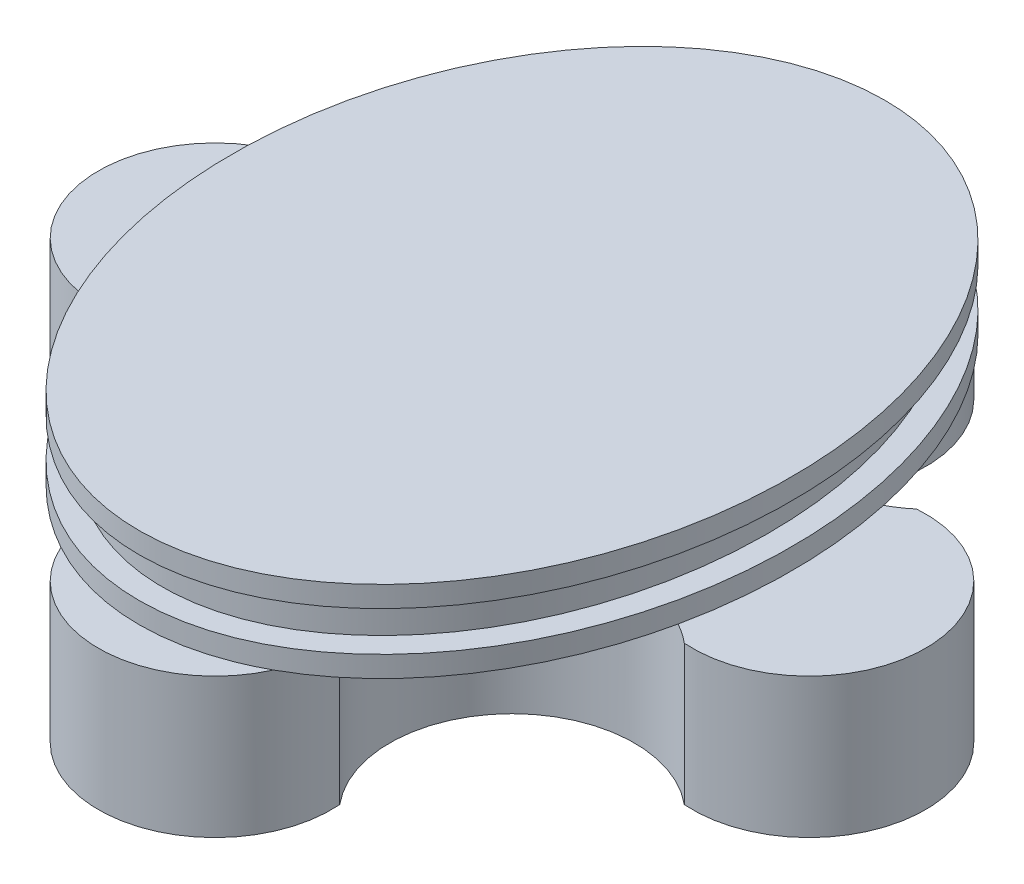
ISO-10303-21;
HEADER;
FILE_DESCRIPTION(('STEP AP214'),'2;1');
FILE_NAME('part.step','',(''),(''),'','','');
FILE_SCHEMA(('AUTOMOTIVE_DESIGN { 1 0 10303 214 1 1 1 1 }'));
ENDSEC;
DATA;
#1=APPLICATION_CONTEXT('core data for automotive mechanical design processes');
#2=APPLICATION_PROTOCOL_DEFINITION('international standard','automotive_design',2000,#1);
#3=PRODUCT_CONTEXT('',#1,'mechanical');
#4=PRODUCT('Part','Part','',(#3));
#5=PRODUCT_RELATED_PRODUCT_CATEGORY('part','',(#4));
#6=PRODUCT_DEFINITION_FORMATION('','',#4);
#7=PRODUCT_DEFINITION_CONTEXT('part definition',#1,'design');
#8=PRODUCT_DEFINITION('design','',#6,#7);
#9=PRODUCT_DEFINITION_SHAPE('','',#8);
#10=(LENGTH_UNIT() NAMED_UNIT(*) SI_UNIT(.MILLI.,.METRE.));
#11=(NAMED_UNIT(*) PLANE_ANGLE_UNIT() SI_UNIT($,.RADIAN.));
#12=(NAMED_UNIT(*) SI_UNIT($,.STERADIAN.) SOLID_ANGLE_UNIT());
#13=UNCERTAINTY_MEASURE_WITH_UNIT(LENGTH_MEASURE(1.E-05),#10,'distance_accuracy_value','');
#14=(GEOMETRIC_REPRESENTATION_CONTEXT(3) GLOBAL_UNCERTAINTY_ASSIGNED_CONTEXT((#13)) GLOBAL_UNIT_ASSIGNED_CONTEXT((#10,
#11,#12)) REPRESENTATION_CONTEXT('',''));
#15=CARTESIAN_POINT('',(0.,0.,0.));
#16=DIRECTION('',(0.,0.,1.));
#17=DIRECTION('',(1.,0.,0.));
#18=AXIS2_PLACEMENT_3D('',#15,#16,#17);
#19=CARTESIAN_POINT('',(0.,0.,0.));
#20=DIRECTION('',(0.,1.,0.));
#21=DIRECTION('',(0.,0.,1.));
#22=AXIS2_PLACEMENT_3D('',#19,#20,#21);
#23=PLANE('',#22);
#24=CARTESIAN_POINT('',(0.,0.,0.));
#25=DIRECTION('',(0.,1.,0.));
#26=DIRECTION('',(0.,0.,-1.));
#27=AXIS2_PLACEMENT_3D('',#24,#25,#26);
#28=ELLIPSE('',#27,16.,12.);
#29=CARTESIAN_POINT('',(-11.5350552187258,0.,4.41059353041869));
#30=VERTEX_POINT('',#29);
#31=CARTESIAN_POINT('',(-4.56069619587107,0.,14.799402402888));
#32=VERTEX_POINT('',#31);
#33=EDGE_CURVE('E224',#30,#32,#28,.T.);
#34=ORIENTED_EDGE('',*,*,#33,.F.);
#35=CARTESIAN_POINT('',(-9.01499999999982,0.,9.01622287878911));
#36=DIRECTION('',(0.,-1.,0.));
#37=DIRECTION('',(0.,0.,-1.));
#38=AXIS2_PLACEMENT_3D('',#35,#36,#37);
#39=CIRCLE('',#38,5.2499999999999);
#40=CARTESIAN_POINT('',(-4.9864961665555,0.,12.3827725760197));
#41=VERTEX_POINT('',#40);
#42=EDGE_CURVE('E55',#30,#41,#39,.T.);
#43=ORIENTED_EDGE('',*,*,#42,.T.);
#44=CARTESIAN_POINT('',(2.5381832073261E-13,0.,12.75));
#45=DIRECTION('',(0.,-1.,0.));
#46=DIRECTION('',(0.,0.,-1.));
#47=AXIS2_PLACEMENT_3D('',#44,#45,#46);
#48=CIRCLE('',#47,4.99999999999984);
#49=EDGE_CURVE('E191',#32,#41,#48,.T.);
#50=ORIENTED_EDGE('',*,*,#49,.F.);
#51=EDGE_LOOP('',(#34,#43,#50));
#52=FACE_BOUND('',#51,.T.);
#53=ADVANCED_FACE('F45',(#52),#23,.F.);
#54=CARTESIAN_POINT('',(0.,0.,-12.75));
#55=DIRECTION('',(0.,-1.,0.));
#56=DIRECTION('',(0.,0.,-1.));
#57=AXIS2_PLACEMENT_3D('',#54,#55,#56);
#58=CIRCLE('',#57,5.);
#59=CARTESIAN_POINT('',(-4.98627820309729,0.,-12.3798247964586));
#60=VERTEX_POINT('',#59);
#61=CARTESIAN_POINT('',(-4.56069619587164,0.,-14.7994024028877));
#62=VERTEX_POINT('',#61);
#63=EDGE_CURVE('E174',#60,#62,#58,.T.);
#64=ORIENTED_EDGE('',*,*,#63,.F.);
#65=CARTESIAN_POINT('',(-9.01622287878913,0.,-9.01499999999997));
#66=DIRECTION('',(0.,-1.,0.));
#67=DIRECTION('',(0.,0.,-1.));
#68=AXIS2_PLACEMENT_3D('',#65,#66,#67);
#69=CIRCLE('',#68,5.25);
#70=CARTESIAN_POINT('',(-11.5354192149795,0.,-4.40890080222699));
#71=VERTEX_POINT('',#70);
#72=EDGE_CURVE('E145',#60,#71,#69,.T.);
#73=ORIENTED_EDGE('',*,*,#72,.T.);
#74=EDGE_CURVE('E217',#62,#71,#28,.T.);
#75=ORIENTED_EDGE('',*,*,#74,.F.);
#76=EDGE_LOOP('',(#64,#73,#75));
#77=FACE_BOUND('',#76,.T.);
#78=ADVANCED_FACE('F262',(#77),#23,.F.);
#79=CARTESIAN_POINT('',(4.98627820309738,0.,12.3798247964586));
#80=VERTEX_POINT('',#79);
#81=CARTESIAN_POINT('',(4.56069619587174,0.,14.7994024028877));
#82=VERTEX_POINT('',#81);
#83=EDGE_CURVE('E187',#80,#82,#48,.T.);
#84=ORIENTED_EDGE('',*,*,#83,.F.);
#85=CARTESIAN_POINT('',(9.01622287878919,0.,9.01499999999991));
#86=DIRECTION('',(0.,-1.,0.));
#87=DIRECTION('',(0.,0.,-1.));
#88=AXIS2_PLACEMENT_3D('',#85,#86,#87);
#89=CIRCLE('',#88,5.25);
#90=CARTESIAN_POINT('',(11.5354192149795,0.,4.4089008022269));
#91=VERTEX_POINT('',#90);
#92=EDGE_CURVE('E183',#80,#91,#89,.T.);
#93=ORIENTED_EDGE('',*,*,#92,.T.);
#94=EDGE_CURVE('E230',#82,#91,#28,.T.);
#95=ORIENTED_EDGE('',*,*,#94,.F.);
#96=EDGE_LOOP('',(#84,#93,#95));
#97=FACE_BOUND('',#96,.T.);
#98=ADVANCED_FACE('F266',(#97),#23,.F.);
#99=CARTESIAN_POINT('',(0.,0.9,0.));
#100=DIRECTION('',(0.,1.,0.));
#101=DIRECTION('',(0.,0.,-1.));
#102=AXIS2_PLACEMENT_3D('',#99,#100,#101);
#103=ELLIPSE('',#102,16.,12.);
#104=DIRECTION('',(0.,-1.,0.));
#105=VECTOR('',#104,1.);
#106=SURFACE_OF_LINEAR_EXTRUSION('',#103,#105);
#107=CARTESIAN_POINT('',(0.,0.9,-16.));
#108=VERTEX_POINT('',#107);
#109=EDGE_CURVE('E214',#108,#108,#103,.T.);
#110=ORIENTED_EDGE('',*,*,#109,.F.);
#111=EDGE_LOOP('',(#110));
#112=FACE_BOUND('',#111,.T.);
#113=ORIENTED_EDGE('',*,*,#74,.T.);
#114=EDGE_CURVE('E219',#71,#30,#28,.T.);
#115=ORIENTED_EDGE('',*,*,#114,.T.);
#116=ORIENTED_EDGE('',*,*,#33,.T.);
#117=EDGE_CURVE('E232',#32,#82,#28,.T.);
#118=ORIENTED_EDGE('',*,*,#117,.T.);
#119=ORIENTED_EDGE('',*,*,#94,.T.);
#120=CARTESIAN_POINT('',(11.5350552187259,0.,-4.41059353041851));
#121=VERTEX_POINT('',#120);
#122=EDGE_CURVE('E227',#91,#121,#28,.T.);
#123=ORIENTED_EDGE('',*,*,#122,.T.);
#124=CARTESIAN_POINT('',(4.56069619587164,0.,-14.7994024028877));
#125=VERTEX_POINT('',#124);
#126=EDGE_CURVE('E225',#121,#125,#28,.T.);
#127=ORIENTED_EDGE('',*,*,#126,.T.);
#128=EDGE_CURVE('E152',#125,#62,#28,.T.);
#129=ORIENTED_EDGE('',*,*,#128,.T.);
#130=EDGE_LOOP('',(#113,#115,#116,#118,#119,#123,#127,#129));
#131=FACE_BOUND('',#130,.T.);
#132=ADVANCED_FACE('F47',(#112,#131),#106,.F.);
#133=CARTESIAN_POINT('',(0.,0.9,0.));
#134=DIRECTION('',(0.,1.,0.));
#135=DIRECTION('',(0.,0.,1.));
#136=AXIS2_PLACEMENT_3D('',#133,#134,#135);
#137=PLANE('',#136);
#138=CARTESIAN_POINT('',(0.,0.9,0.));
#139=DIRECTION('',(0.,1.,0.));
#140=DIRECTION('',(0.,0.,-1.));
#141=AXIS2_PLACEMENT_3D('',#138,#139,#140);
#142=ELLIPSE('',#141,15.,11.);
#143=CARTESIAN_POINT('',(0.,0.9,-15.));
#144=VERTEX_POINT('',#143);
#145=EDGE_CURVE('E11',#144,#144,#142,.T.);
#146=ORIENTED_EDGE('',*,*,#145,.F.);
#147=EDGE_LOOP('',(#146));
#148=FACE_BOUND('',#147,.T.);
#149=ORIENTED_EDGE('',*,*,#109,.T.);
#150=EDGE_LOOP('',(#149));
#151=FACE_BOUND('',#150,.T.);
#152=ADVANCED_FACE('F270',(#148,#151),#137,.T.);
#153=CARTESIAN_POINT('',(4.98649616655595,0.,-12.3827725760202));
#154=VERTEX_POINT('',#153);
#155=EDGE_CURVE('E151',#125,#154,#58,.T.);
#156=ORIENTED_EDGE('',*,*,#155,.F.);
#157=ORIENTED_EDGE('',*,*,#126,.F.);
#158=CARTESIAN_POINT('',(9.015,0.,-9.0162228787891));
#159=DIRECTION('',(0.,-1.,0.));
#160=DIRECTION('',(0.,0.,-1.));
#161=AXIS2_PLACEMENT_3D('',#158,#159,#160);
#162=CIRCLE('',#161,5.25);
#163=EDGE_CURVE('E68',#121,#154,#162,.T.);
#164=ORIENTED_EDGE('',*,*,#163,.T.);
#165=EDGE_LOOP('',(#156,#157,#164));
#166=FACE_BOUND('',#165,.T.);
#167=ADVANCED_FACE('F257',(#166),#23,.F.);
#168=CARTESIAN_POINT('',(0.,0.,0.));
#169=DIRECTION('',(0.,-1.,0.));
#170=DIRECTION('',(0.,0.,-1.));
#171=AXIS2_PLACEMENT_3D('',#168,#169,#170);
#172=PLANE('',#171);
#173=ORIENTED_EDGE('',*,*,#114,.F.);
#174=CARTESIAN_POINT('',(-12.3827725760202,0.,-4.9864961665559));
#175=VERTEX_POINT('',#174);
#176=EDGE_CURVE('E197',#71,#175,#69,.T.);
#177=ORIENTED_EDGE('',*,*,#176,.T.);
#178=CARTESIAN_POINT('',(-12.75,0.,0.));
#179=DIRECTION('',(0.,-1.,0.));
#180=DIRECTION('',(0.,0.,-1.));
#181=AXIS2_PLACEMENT_3D('',#178,#179,#180);
#182=CIRCLE('',#181,5.);
#183=CARTESIAN_POINT('',(-12.3798247964584,0.,4.98627820309731));
#184=VERTEX_POINT('',#183);
#185=EDGE_CURVE('E194',#184,#175,#182,.T.);
#186=ORIENTED_EDGE('',*,*,#185,.F.);
#187=EDGE_CURVE('E190',#184,#30,#39,.T.);
#188=ORIENTED_EDGE('',*,*,#187,.T.);
#189=EDGE_LOOP('',(#173,#177,#186,#188));
#190=FACE_BOUND('',#189,.T.);
#191=ADVANCED_FACE('F249',(#190),#172,.F.);
#192=ORIENTED_EDGE('',*,*,#117,.F.);
#193=EDGE_CURVE('E186',#82,#32,#48,.T.);
#194=ORIENTED_EDGE('',*,*,#193,.F.);
#195=EDGE_LOOP('',(#192,#194));
#196=FACE_BOUND('',#195,.T.);
#197=ADVANCED_FACE('F246',(#196),#172,.F.);
#198=ORIENTED_EDGE('',*,*,#122,.F.);
#199=CARTESIAN_POINT('',(12.3827725760202,0.,4.98649616655582));
#200=VERTEX_POINT('',#199);
#201=EDGE_CURVE('E182',#91,#200,#89,.T.);
#202=ORIENTED_EDGE('',*,*,#201,.T.);
#203=CARTESIAN_POINT('',(12.75,0.,-1.3354916121075E-13));
#204=DIRECTION('',(0.,-1.,0.));
#205=DIRECTION('',(0.,0.,-1.));
#206=AXIS2_PLACEMENT_3D('',#203,#204,#205);
#207=CIRCLE('',#206,5.);
#208=CARTESIAN_POINT('',(12.3798247964589,0.,-4.98627820309744));
#209=VERTEX_POINT('',#208);
#210=EDGE_CURVE('E179',#209,#200,#207,.T.);
#211=ORIENTED_EDGE('',*,*,#210,.F.);
#212=EDGE_CURVE('E176',#209,#121,#162,.T.);
#213=ORIENTED_EDGE('',*,*,#212,.T.);
#214=EDGE_LOOP('',(#198,#202,#211,#213));
#215=FACE_BOUND('',#214,.T.);
#216=ADVANCED_FACE('F248',(#215),#172,.F.);
#217=CARTESIAN_POINT('',(0.,-6.,-12.75));
#218=DIRECTION('',(0.,1.,0.));
#219=DIRECTION('',(0.,0.,1.));
#220=AXIS2_PLACEMENT_3D('',#217,#218,#219);
#221=CYLINDRICAL_SURFACE('',#220,5.);
#222=ORIENTED_EDGE('',*,*,#63,.T.);
#223=EDGE_CURVE('E177',#62,#125,#58,.T.);
#224=ORIENTED_EDGE('',*,*,#223,.T.);
#225=ORIENTED_EDGE('',*,*,#155,.T.);
#226=DIRECTION('',(0.,1.,0.));
#227=VECTOR('',#226,1.);
#228=CARTESIAN_POINT('',(4.98649616655595,-6.,-12.3827725760202));
#229=LINE('',#228,#227);
#230=CARTESIAN_POINT('',(4.98649616655595,-6.,-12.3827725760202));
#231=VERTEX_POINT('',#230);
#232=EDGE_CURVE('E63',#231,#154,#229,.T.);
#233=ORIENTED_EDGE('',*,*,#232,.F.);
#234=CARTESIAN_POINT('',(0.,-6.,-12.75));
#235=DIRECTION('',(0.,-1.,0.));
#236=DIRECTION('',(0.,0.,-1.));
#237=AXIS2_PLACEMENT_3D('',#234,#235,#236);
#238=CIRCLE('',#237,5.);
#239=CARTESIAN_POINT('',(-4.98627820309729,-6.,-12.3798247964586));
#240=VERTEX_POINT('',#239);
#241=EDGE_CURVE('E139',#240,#231,#238,.T.);
#242=ORIENTED_EDGE('',*,*,#241,.F.);
#243=DIRECTION('',(0.,1.,0.));
#244=VECTOR('',#243,1.);
#245=CARTESIAN_POINT('',(-4.98627820309729,-6.,-12.3798247964586));
#246=LINE('',#245,#244);
#247=EDGE_CURVE('E173',#240,#60,#246,.T.);
#248=ORIENTED_EDGE('',*,*,#247,.T.);
#249=EDGE_LOOP('',(#222,#224,#225,#233,#242,#248));
#250=FACE_BOUND('',#249,.T.);
#251=ADVANCED_FACE('F148',(#250),#221,.T.);
#252=CARTESIAN_POINT('',(9.015,-6.,-9.0162228787891));
#253=DIRECTION('',(0.,1.,0.));
#254=DIRECTION('',(0.,0.,1.));
#255=AXIS2_PLACEMENT_3D('',#252,#253,#254);
#256=CYLINDRICAL_SURFACE('',#255,5.25);
#257=ORIENTED_EDGE('',*,*,#212,.F.);
#258=DIRECTION('',(0.,1.,0.));
#259=VECTOR('',#258,1.);
#260=CARTESIAN_POINT('',(12.3798247964589,-6.,-4.98627820309744));
#261=LINE('',#260,#259);
#262=CARTESIAN_POINT('',(12.3798247964589,-6.,-4.98627820309744));
#263=VERTEX_POINT('',#262);
#264=EDGE_CURVE('E153',#263,#209,#261,.T.);
#265=ORIENTED_EDGE('',*,*,#264,.F.);
#266=CARTESIAN_POINT('',(9.015,-6.,-9.0162228787891));
#267=DIRECTION('',(0.,-1.,0.));
#268=DIRECTION('',(0.,0.,-1.));
#269=AXIS2_PLACEMENT_3D('',#266,#267,#268);
#270=CIRCLE('',#269,5.25);
#271=EDGE_CURVE('E141',#263,#231,#270,.T.);
#272=ORIENTED_EDGE('',*,*,#271,.T.);
#273=ORIENTED_EDGE('',*,*,#232,.T.);
#274=ORIENTED_EDGE('',*,*,#163,.F.);
#275=EDGE_LOOP('',(#257,#265,#272,#273,#274));
#276=FACE_BOUND('',#275,.T.);
#277=ADVANCED_FACE('F155',(#276),#256,.F.);
#278=CARTESIAN_POINT('',(12.75,-6.,-1.3354916121075E-13));
#279=DIRECTION('',(0.,1.,0.));
#280=DIRECTION('',(0.,0.,1.));
#281=AXIS2_PLACEMENT_3D('',#278,#279,#280);
#282=CYLINDRICAL_SURFACE('',#281,5.);
#283=ORIENTED_EDGE('',*,*,#210,.T.);
#284=DIRECTION('',(0.,1.,0.));
#285=VECTOR('',#284,1.);
#286=CARTESIAN_POINT('',(12.3827725760202,-6.,4.98649616655582));
#287=LINE('',#286,#285);
#288=CARTESIAN_POINT('',(12.3827725760202,-6.,4.98649616655582));
#289=VERTEX_POINT('',#288);
#290=EDGE_CURVE('E211',#289,#200,#287,.T.);
#291=ORIENTED_EDGE('',*,*,#290,.F.);
#292=CARTESIAN_POINT('',(12.75,-6.,-1.3354916121075E-13));
#293=DIRECTION('',(0.,-1.,0.));
#294=DIRECTION('',(0.,0.,-1.));
#295=AXIS2_PLACEMENT_3D('',#292,#293,#294);
#296=CIRCLE('',#295,5.);
#297=EDGE_CURVE('E157',#263,#289,#296,.T.);
#298=ORIENTED_EDGE('',*,*,#297,.F.);
#299=ORIENTED_EDGE('',*,*,#264,.T.);
#300=EDGE_LOOP('',(#283,#291,#298,#299));
#301=FACE_BOUND('',#300,.T.);
#302=ADVANCED_FACE('F290',(#301),#282,.T.);
#303=CARTESIAN_POINT('',(9.01622287878919,-6.,9.01499999999991));
#304=DIRECTION('',(0.,1.,0.));
#305=DIRECTION('',(0.,0.,1.));
#306=AXIS2_PLACEMENT_3D('',#303,#304,#305);
#307=CYLINDRICAL_SURFACE('',#306,5.25);
#308=ORIENTED_EDGE('',*,*,#92,.F.);
#309=DIRECTION('',(0.,1.,0.));
#310=VECTOR('',#309,1.);
#311=CARTESIAN_POINT('',(4.98627820309738,-6.,12.3798247964586));
#312=LINE('',#311,#310);
#313=CARTESIAN_POINT('',(4.98627820309738,-6.,12.3798247964586));
#314=VERTEX_POINT('',#313);
#315=EDGE_CURVE('E209',#314,#80,#312,.T.);
#316=ORIENTED_EDGE('',*,*,#315,.F.);
#317=CARTESIAN_POINT('',(9.01622287878919,-6.,9.01499999999991));
#318=DIRECTION('',(0.,-1.,0.));
#319=DIRECTION('',(0.,0.,-1.));
#320=AXIS2_PLACEMENT_3D('',#317,#318,#319);
#321=CIRCLE('',#320,5.25);
#322=EDGE_CURVE('E159',#314,#289,#321,.T.);
#323=ORIENTED_EDGE('',*,*,#322,.T.);
#324=ORIENTED_EDGE('',*,*,#290,.T.);
#325=ORIENTED_EDGE('',*,*,#201,.F.);
#326=EDGE_LOOP('',(#308,#316,#323,#324,#325));
#327=FACE_BOUND('',#326,.T.);
#328=ADVANCED_FACE('F285',(#327),#307,.F.);
#329=CARTESIAN_POINT('',(2.5381832073261E-13,-6.,12.75));
#330=DIRECTION('',(0.,1.,0.));
#331=DIRECTION('',(0.,0.,1.));
#332=AXIS2_PLACEMENT_3D('',#329,#330,#331);
#333=CYLINDRICAL_SURFACE('',#332,4.99999999999984);
#334=ORIENTED_EDGE('',*,*,#83,.T.);
#335=ORIENTED_EDGE('',*,*,#193,.T.);
#336=ORIENTED_EDGE('',*,*,#49,.T.);
#337=DIRECTION('',(0.,1.,0.));
#338=VECTOR('',#337,1.);
#339=CARTESIAN_POINT('',(-4.9864961665555,-6.,12.3827725760197));
#340=LINE('',#339,#338);
#341=CARTESIAN_POINT('',(-4.9864961665555,-6.,12.3827725760197));
#342=VERTEX_POINT('',#341);
#343=EDGE_CURVE('E206',#342,#41,#340,.T.);
#344=ORIENTED_EDGE('',*,*,#343,.F.);
#345=CARTESIAN_POINT('',(2.5381832073261E-13,-6.,12.75));
#346=DIRECTION('',(0.,-1.,0.));
#347=DIRECTION('',(0.,0.,-1.));
#348=AXIS2_PLACEMENT_3D('',#345,#346,#347);
#349=CIRCLE('',#348,4.99999999999984);
#350=EDGE_CURVE('E165',#314,#342,#349,.T.);
#351=ORIENTED_EDGE('',*,*,#350,.F.);
#352=ORIENTED_EDGE('',*,*,#315,.T.);
#353=EDGE_LOOP('',(#334,#335,#336,#344,#351,#352));
#354=FACE_BOUND('',#353,.T.);
#355=ADVANCED_FACE('F243',(#354),#333,.T.);
#356=CARTESIAN_POINT('',(-9.01499999999982,-6.,9.01622287878911));
#357=DIRECTION('',(0.,1.,0.));
#358=DIRECTION('',(0.,0.,1.));
#359=AXIS2_PLACEMENT_3D('',#356,#357,#358);
#360=CYLINDRICAL_SURFACE('',#359,5.2499999999999);
#361=ORIENTED_EDGE('',*,*,#187,.F.);
#362=DIRECTION('',(0.,1.,0.));
#363=VECTOR('',#362,1.);
#364=CARTESIAN_POINT('',(-12.3798247964584,-6.,4.98627820309731));
#365=LINE('',#364,#363);
#366=CARTESIAN_POINT('',(-12.3798247964584,-6.,4.98627820309731));
#367=VERTEX_POINT('',#366);
#368=EDGE_CURVE('E204',#367,#184,#365,.T.);
#369=ORIENTED_EDGE('',*,*,#368,.F.);
#370=CARTESIAN_POINT('',(-9.01499999999982,-6.,9.01622287878911));
#371=DIRECTION('',(0.,-1.,0.));
#372=DIRECTION('',(0.,0.,-1.));
#373=AXIS2_PLACEMENT_3D('',#370,#371,#372);
#374=CIRCLE('',#373,5.2499999999999);
#375=EDGE_CURVE('E167',#367,#342,#374,.T.);
#376=ORIENTED_EDGE('',*,*,#375,.T.);
#377=ORIENTED_EDGE('',*,*,#343,.T.);
#378=ORIENTED_EDGE('',*,*,#42,.F.);
#379=EDGE_LOOP('',(#361,#369,#376,#377,#378));
#380=FACE_BOUND('',#379,.T.);
#381=ADVANCED_FACE('F295',(#380),#360,.F.);
#382=CARTESIAN_POINT('',(-12.75,-6.,0.));
#383=DIRECTION('',(0.,1.,0.));
#384=DIRECTION('',(0.,0.,1.));
#385=AXIS2_PLACEMENT_3D('',#382,#383,#384);
#386=CYLINDRICAL_SURFACE('',#385,5.);
#387=ORIENTED_EDGE('',*,*,#185,.T.);
#388=DIRECTION('',(0.,1.,0.));
#389=VECTOR('',#388,1.);
#390=CARTESIAN_POINT('',(-12.3827725760202,-6.,-4.9864961665559));
#391=LINE('',#390,#389);
#392=CARTESIAN_POINT('',(-12.3827725760202,-6.,-4.9864961665559));
#393=VERTEX_POINT('',#392);
#394=EDGE_CURVE('E201',#393,#175,#391,.T.);
#395=ORIENTED_EDGE('',*,*,#394,.F.);
#396=CARTESIAN_POINT('',(-12.75,-6.,0.));
#397=DIRECTION('',(0.,-1.,0.));
#398=DIRECTION('',(0.,0.,-1.));
#399=AXIS2_PLACEMENT_3D('',#396,#397,#398);
#400=CIRCLE('',#399,5.);
#401=EDGE_CURVE('E170',#367,#393,#400,.T.);
#402=ORIENTED_EDGE('',*,*,#401,.F.);
#403=ORIENTED_EDGE('',*,*,#368,.T.);
#404=EDGE_LOOP('',(#387,#395,#402,#403));
#405=FACE_BOUND('',#404,.T.);
#406=ADVANCED_FACE('F300',(#405),#386,.T.);
#407=CARTESIAN_POINT('',(-9.01622287878913,-6.,-9.01499999999997));
#408=DIRECTION('',(0.,1.,0.));
#409=DIRECTION('',(0.,0.,1.));
#410=AXIS2_PLACEMENT_3D('',#407,#408,#409);
#411=CYLINDRICAL_SURFACE('',#410,5.25);
#412=ORIENTED_EDGE('',*,*,#72,.F.);
#413=ORIENTED_EDGE('',*,*,#247,.F.);
#414=CARTESIAN_POINT('',(-9.01622287878913,-6.,-9.01499999999997));
#415=DIRECTION('',(0.,-1.,0.));
#416=DIRECTION('',(0.,0.,-1.));
#417=AXIS2_PLACEMENT_3D('',#414,#415,#416);
#418=CIRCLE('',#417,5.25);
#419=EDGE_CURVE('E143',#240,#393,#418,.T.);
#420=ORIENTED_EDGE('',*,*,#419,.T.);
#421=ORIENTED_EDGE('',*,*,#394,.T.);
#422=ORIENTED_EDGE('',*,*,#176,.F.);
#423=EDGE_LOOP('',(#412,#413,#420,#421,#422));
#424=FACE_BOUND('',#423,.T.);
#425=ADVANCED_FACE('F304',(#424),#411,.F.);
#426=CARTESIAN_POINT('',(0.,-6.,0.));
#427=DIRECTION('',(0.,-1.,0.));
#428=DIRECTION('',(0.,0.,-1.));
#429=AXIS2_PLACEMENT_3D('',#426,#427,#428);
#430=PLANE('',#429);
#431=CARTESIAN_POINT('',(0.,-6.,0.));
#432=DIRECTION('',(0.,-1.,0.));
#433=DIRECTION('',(0.,0.,-1.));
#434=AXIS2_PLACEMENT_3D('',#431,#432,#433);
#435=CIRCLE('',#434,3.);
#436=CARTESIAN_POINT('',(0.,-6.,-3.));
#437=VERTEX_POINT('',#436);
#438=EDGE_CURVE('E50',#437,#437,#435,.T.);
#439=ORIENTED_EDGE('',*,*,#438,.F.);
#440=EDGE_LOOP('',(#439));
#441=FACE_BOUND('',#440,.T.);
#442=ORIENTED_EDGE('',*,*,#241,.T.);
#443=ORIENTED_EDGE('',*,*,#271,.F.);
#444=ORIENTED_EDGE('',*,*,#297,.T.);
#445=ORIENTED_EDGE('',*,*,#322,.F.);
#446=ORIENTED_EDGE('',*,*,#350,.T.);
#447=ORIENTED_EDGE('',*,*,#375,.F.);
#448=ORIENTED_EDGE('',*,*,#401,.T.);
#449=ORIENTED_EDGE('',*,*,#419,.F.);
#450=EDGE_LOOP('',(#442,#443,#444,#445,#446,#447,#448,#449));
#451=FACE_BOUND('',#450,.T.);
#452=ADVANCED_FACE('F140',(#441,#451),#430,.T.);
#453=ORIENTED_EDGE('',*,*,#128,.F.);
#454=ORIENTED_EDGE('',*,*,#223,.F.);
#455=EDGE_LOOP('',(#453,#454));
#456=FACE_BOUND('',#455,.T.);
#457=ADVANCED_FACE('F256',(#456),#172,.F.);
#458=CARTESIAN_POINT('',(0.,-9.1,0.));
#459=DIRECTION('',(0.,1.,0.));
#460=DIRECTION('',(0.,0.,1.));
#461=AXIS2_PLACEMENT_3D('',#458,#459,#460);
#462=CYLINDRICAL_SURFACE('',#461,3.);
#463=ORIENTED_EDGE('',*,*,#438,.T.);
#464=EDGE_LOOP('',(#463));
#465=FACE_BOUND('',#464,.T.);
#466=CARTESIAN_POINT('',(0.,0.9,0.));
#467=DIRECTION('',(0.,1.,0.));
#468=DIRECTION('',(0.,0.,1.));
#469=AXIS2_PLACEMENT_3D('',#466,#467,#468);
#470=CIRCLE('',#469,3.);
#471=CARTESIAN_POINT('',(0.,0.9,3.));
#472=VERTEX_POINT('',#471);
#473=EDGE_CURVE('E308',#472,#472,#470,.T.);
#474=ORIENTED_EDGE('',*,*,#473,.T.);
#475=EDGE_LOOP('',(#474));
#476=FACE_BOUND('',#475,.T.);
#477=ADVANCED_FACE('F328',(#465,#476),#462,.F.);
#478=CARTESIAN_POINT('',(0.,2.6,0.));
#479=DIRECTION('',(0.,1.,0.));
#480=DIRECTION('',(0.,0.,-1.));
#481=AXIS2_PLACEMENT_3D('',#478,#479,#480);
#482=ELLIPSE('',#481,15.,11.);
#483=DIRECTION('',(0.,-1.,0.));
#484=VECTOR('',#483,1.);
#485=SURFACE_OF_LINEAR_EXTRUSION('',#482,#484);
#486=CARTESIAN_POINT('',(0.,2.6,-15.));
#487=VERTEX_POINT('',#486);
#488=EDGE_CURVE('E312',#487,#487,#482,.T.);
#489=ORIENTED_EDGE('',*,*,#488,.F.);
#490=EDGE_LOOP('',(#489));
#491=FACE_BOUND('',#490,.T.);
#492=ORIENTED_EDGE('',*,*,#145,.T.);
#493=EDGE_LOOP('',(#492));
#494=FACE_BOUND('',#493,.T.);
#495=ADVANCED_FACE('F323',(#491,#494),#485,.F.);
#496=CARTESIAN_POINT('',(0.,0.9,0.));
#497=DIRECTION('',(0.,1.,0.));
#498=DIRECTION('',(0.,0.,1.));
#499=AXIS2_PLACEMENT_3D('',#496,#497,#498);
#500=PLANE('',#499);
#501=ORIENTED_EDGE('',*,*,#473,.F.);
#502=EDGE_LOOP('',(#501));
#503=FACE_BOUND('',#502,.T.);
#504=ADVANCED_FACE('F327',(#503),#500,.F.);
#505=CARTESIAN_POINT('',(0.,3.5,0.));
#506=DIRECTION('',(0.,1.,0.));
#507=DIRECTION('',(0.,0.,-1.));
#508=AXIS2_PLACEMENT_3D('',#505,#506,#507);
#509=ELLIPSE('',#508,16.,12.);
#510=DIRECTION('',(0.,-1.,0.));
#511=VECTOR('',#510,1.);
#512=SURFACE_OF_LINEAR_EXTRUSION('',#509,#511);
#513=CARTESIAN_POINT('',(0.,3.5,-16.));
#514=VERTEX_POINT('',#513);
#515=EDGE_CURVE('E316',#514,#514,#509,.T.);
#516=ORIENTED_EDGE('',*,*,#515,.F.);
#517=EDGE_LOOP('',(#516));
#518=FACE_BOUND('',#517,.T.);
#519=CARTESIAN_POINT('',(0.,2.6,0.));
#520=DIRECTION('',(0.,1.,0.));
#521=DIRECTION('',(0.,0.,-1.));
#522=AXIS2_PLACEMENT_3D('',#519,#520,#521);
#523=ELLIPSE('',#522,16.,12.);
#524=CARTESIAN_POINT('',(0.,2.6,-16.));
#525=VERTEX_POINT('',#524);
#526=EDGE_CURVE('E320',#525,#525,#523,.T.);
#527=ORIENTED_EDGE('',*,*,#526,.T.);
#528=EDGE_LOOP('',(#527));
#529=FACE_BOUND('',#528,.T.);
#530=ADVANCED_FACE('F434',(#518,#529),#512,.F.);
#531=CARTESIAN_POINT('',(0.,3.5,0.));
#532=DIRECTION('',(0.,1.,0.));
#533=DIRECTION('',(0.,0.,1.));
#534=AXIS2_PLACEMENT_3D('',#531,#532,#533);
#535=PLANE('',#534);
#536=ORIENTED_EDGE('',*,*,#515,.T.);
#537=EDGE_LOOP('',(#536));
#538=FACE_BOUND('',#537,.T.);
#539=ADVANCED_FACE('F444',(#538),#535,.T.);
#540=CARTESIAN_POINT('',(0.,2.6,0.));
#541=DIRECTION('',(0.,1.,0.));
#542=DIRECTION('',(0.,0.,1.));
#543=AXIS2_PLACEMENT_3D('',#540,#541,#542);
#544=PLANE('',#543);
#545=ORIENTED_EDGE('',*,*,#488,.T.);
#546=EDGE_LOOP('',(#545));
#547=FACE_BOUND('',#546,.T.);
#548=ORIENTED_EDGE('',*,*,#526,.F.);
#549=EDGE_LOOP('',(#548));
#550=FACE_BOUND('',#549,.T.);
#551=ADVANCED_FACE('F454',(#547,#550),#544,.F.);
#552=CLOSED_SHELL('',(#53,#78,#98,#132,#152,#167,#191,#197,#216,#251,#277,#302,#328,#355,#381,
#406,#425,#452,#457,#477,#495,#504,#530,#539,#551));
#553=MANIFOLD_SOLID_BREP('B2',#552);
#554=ADVANCED_BREP_SHAPE_REPRESENTATION('',(#18,#553),#14);
#555=SHAPE_DEFINITION_REPRESENTATION(#9,#554);
ENDSEC;
END-ISO-10303-21;
